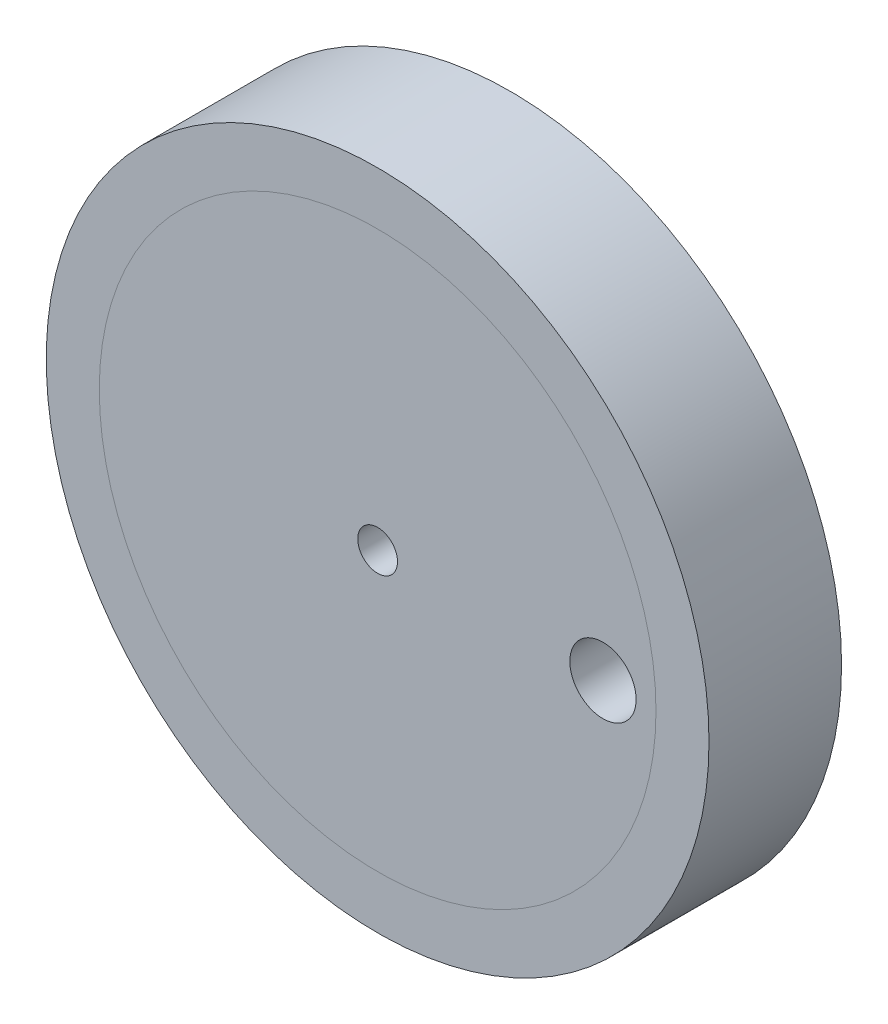
ISO-10303-21;
HEADER;
FILE_DESCRIPTION(('STEP AP214'),'2;1');
FILE_NAME('part.step','',(''),(''),'','','');
FILE_SCHEMA(('AUTOMOTIVE_DESIGN { 1 0 10303 214 1 1 1 1 }'));
ENDSEC;
DATA;
#1=APPLICATION_CONTEXT('core data for automotive mechanical design processes');
#2=APPLICATION_PROTOCOL_DEFINITION('international standard','automotive_design',2000,#1);
#3=PRODUCT_CONTEXT('',#1,'mechanical');
#4=PRODUCT('Part','Part','',(#3));
#5=PRODUCT_RELATED_PRODUCT_CATEGORY('part','',(#4));
#6=PRODUCT_DEFINITION_FORMATION('','',#4);
#7=PRODUCT_DEFINITION_CONTEXT('part definition',#1,'design');
#8=PRODUCT_DEFINITION('design','',#6,#7);
#9=PRODUCT_DEFINITION_SHAPE('','',#8);
#10=(LENGTH_UNIT() NAMED_UNIT(*) SI_UNIT(.MILLI.,.METRE.));
#11=(NAMED_UNIT(*) PLANE_ANGLE_UNIT() SI_UNIT($,.RADIAN.));
#12=(NAMED_UNIT(*) SI_UNIT($,.STERADIAN.) SOLID_ANGLE_UNIT());
#13=UNCERTAINTY_MEASURE_WITH_UNIT(LENGTH_MEASURE(1.E-05),#10,'distance_accuracy_value','');
#14=(GEOMETRIC_REPRESENTATION_CONTEXT(3) GLOBAL_UNCERTAINTY_ASSIGNED_CONTEXT((#13)) GLOBAL_UNIT_ASSIGNED_CONTEXT((#10,
#11,#12)) REPRESENTATION_CONTEXT('',''));
#15=CARTESIAN_POINT('',(0.,0.,0.));
#16=DIRECTION('',(0.,0.,1.));
#17=DIRECTION('',(1.,0.,0.));
#18=AXIS2_PLACEMENT_3D('',#15,#16,#17);
#19=CARTESIAN_POINT('',(-26.1266167793171,11.2614727497056,69.39696961967));
#20=DIRECTION('',(0.,0.,-1.));
#21=DIRECTION('',(-1.,0.,0.));
#22=AXIS2_PLACEMENT_3D('',#19,#20,#21);
#23=CYLINDRICAL_SURFACE('',#22,21.);
#24=CARTESIAN_POINT('',(-26.1266167793171,11.2614727497056,0.));
#25=DIRECTION('',(0.,0.,-1.));
#26=DIRECTION('',(-1.,0.,0.));
#27=AXIS2_PLACEMENT_3D('',#24,#25,#26);
#28=CIRCLE('',#27,21.);
#29=CARTESIAN_POINT('',(-47.1266167793171,11.2614727497056,0.));
#30=VERTEX_POINT('',#29);
#31=EDGE_CURVE('E54',#30,#30,#28,.T.);
#32=ORIENTED_EDGE('',*,*,#31,.F.);
#33=EDGE_LOOP('',(#32));
#34=FACE_BOUND('',#33,.T.);
#35=CARTESIAN_POINT('',(-26.1266167793171,11.2614727497056,10.));
#36=DIRECTION('',(0.,0.,1.));
#37=DIRECTION('',(1.,0.,0.));
#38=AXIS2_PLACEMENT_3D('',#35,#36,#37);
#39=CIRCLE('',#38,21.);
#40=CARTESIAN_POINT('',(-5.12661677931709,11.2614727497056,10.));
#41=VERTEX_POINT('',#40);
#42=EDGE_CURVE('E45',#41,#41,#39,.F.);
#43=ORIENTED_EDGE('',*,*,#42,.T.);
#44=EDGE_LOOP('',(#43));
#45=FACE_BOUND('',#44,.T.);
#46=ADVANCED_FACE('F41',(#34,#45),#23,.T.);
#47=CARTESIAN_POINT('',(-26.1266167793171,11.2614727497056,69.39696961967));
#48=DIRECTION('',(0.,0.,-1.));
#49=DIRECTION('',(-1.,0.,0.));
#50=AXIS2_PLACEMENT_3D('',#47,#48,#49);
#51=CYLINDRICAL_SURFACE('',#50,1.5);
#52=CARTESIAN_POINT('',(-26.1266167793171,11.2614727497056,0.));
#53=DIRECTION('',(0.,0.,-1.));
#54=DIRECTION('',(-1.,0.,0.));
#55=AXIS2_PLACEMENT_3D('',#52,#53,#54);
#56=CIRCLE('',#55,1.5);
#57=CARTESIAN_POINT('',(-27.6266167793171,11.2614727497056,0.));
#58=VERTEX_POINT('',#57);
#59=EDGE_CURVE('E59',#58,#58,#56,.T.);
#60=ORIENTED_EDGE('',*,*,#59,.T.);
#61=EDGE_LOOP('',(#60));
#62=FACE_BOUND('',#61,.T.);
#63=CARTESIAN_POINT('',(-26.1266167793171,11.2614727497056,10.));
#64=DIRECTION('',(0.,0.,1.));
#65=DIRECTION('',(1.,0.,0.));
#66=AXIS2_PLACEMENT_3D('',#63,#64,#65);
#67=CIRCLE('',#66,1.5);
#68=CARTESIAN_POINT('',(-24.6266167793171,11.2614727497056,10.));
#69=VERTEX_POINT('',#68);
#70=EDGE_CURVE('E11',#69,#69,#67,.F.);
#71=ORIENTED_EDGE('',*,*,#70,.F.);
#72=EDGE_LOOP('',(#71));
#73=FACE_BOUND('',#72,.T.);
#74=ADVANCED_FACE('F69',(#62,#73),#51,.F.);
#75=CARTESIAN_POINT('',(-9.12661677931708,11.2614727497056,69.39696961967));
#76=DIRECTION('',(0.,0.,-1.));
#77=DIRECTION('',(-1.,0.,0.));
#78=AXIS2_PLACEMENT_3D('',#75,#76,#77);
#79=CYLINDRICAL_SURFACE('',#78,2.5);
#80=CARTESIAN_POINT('',(-9.12661677931708,11.2614727497056,0.));
#81=DIRECTION('',(0.,0.,-1.));
#82=DIRECTION('',(-1.,0.,0.));
#83=AXIS2_PLACEMENT_3D('',#80,#81,#82);
#84=CIRCLE('',#83,2.5);
#85=CARTESIAN_POINT('',(-11.6266167793171,11.2614727497056,0.));
#86=VERTEX_POINT('',#85);
#87=EDGE_CURVE('E56',#86,#86,#84,.T.);
#88=ORIENTED_EDGE('',*,*,#87,.T.);
#89=EDGE_LOOP('',(#88));
#90=FACE_BOUND('',#89,.T.);
#91=CARTESIAN_POINT('',(-9.12661677931708,11.2614727497056,10.));
#92=DIRECTION('',(0.,0.,1.));
#93=DIRECTION('',(1.,0.,0.));
#94=AXIS2_PLACEMENT_3D('',#91,#92,#93);
#95=CIRCLE('',#94,2.5);
#96=CARTESIAN_POINT('',(-6.62661677931708,11.2614727497056,10.));
#97=VERTEX_POINT('',#96);
#98=EDGE_CURVE('E49',#97,#97,#95,.F.);
#99=ORIENTED_EDGE('',*,*,#98,.F.);
#100=EDGE_LOOP('',(#99));
#101=FACE_BOUND('',#100,.T.);
#102=ADVANCED_FACE('F78',(#90,#101),#79,.F.);
#103=CARTESIAN_POINT('',(-26.1266167793171,11.2614727497056,0.));
#104=DIRECTION('',(0.,0.,-1.));
#105=DIRECTION('',(-1.,0.,0.));
#106=AXIS2_PLACEMENT_3D('',#103,#104,#105);
#107=PLANE('',#106);
#108=ORIENTED_EDGE('',*,*,#87,.F.);
#109=EDGE_LOOP('',(#108));
#110=FACE_BOUND('',#109,.T.);
#111=ORIENTED_EDGE('',*,*,#59,.F.);
#112=EDGE_LOOP('',(#111));
#113=FACE_BOUND('',#112,.T.);
#114=ORIENTED_EDGE('',*,*,#31,.T.);
#115=EDGE_LOOP('',(#114));
#116=FACE_BOUND('',#115,.T.);
#117=ADVANCED_FACE('F65',(#110,#113,#116),#107,.T.);
#118=CARTESIAN_POINT('',(-26.1266167793171,11.2614727497056,10.));
#119=DIRECTION('',(0.,0.,1.));
#120=DIRECTION('',(1.,0.,0.));
#121=AXIS2_PLACEMENT_3D('',#118,#119,#120);
#122=PLANE('',#121);
#123=ORIENTED_EDGE('',*,*,#42,.F.);
#124=EDGE_LOOP('',(#123));
#125=FACE_BOUND('',#124,.T.);
#126=ORIENTED_EDGE('',*,*,#98,.T.);
#127=EDGE_LOOP('',(#126));
#128=FACE_BOUND('',#127,.T.);
#129=ORIENTED_EDGE('',*,*,#70,.T.);
#130=EDGE_LOOP('',(#129));
#131=FACE_BOUND('',#130,.T.);
#132=ADVANCED_FACE('F43',(#125,#128,#131),#122,.T.);
#133=CLOSED_SHELL('',(#46,#74,#102,#117,#132));
#134=MANIFOLD_SOLID_BREP('B2',#133);
#135=CARTESIAN_POINT('',(-26.1266167793171,11.2614727497056,10.));
#136=DIRECTION('',(0.,0.,-1.));
#137=DIRECTION('',(-1.,0.,0.));
#138=AXIS2_PLACEMENT_3D('',#135,#136,#137);
#139=CYLINDRICAL_SURFACE('',#138,25.);
#140=CARTESIAN_POINT('',(-26.1266167793171,11.2614727497056,10.));
#141=DIRECTION('',(0.,0.,1.));
#142=DIRECTION('',(1.,0.,0.));
#143=AXIS2_PLACEMENT_3D('',#140,#141,#142);
#144=CIRCLE('',#143,25.);
#145=CARTESIAN_POINT('',(-1.12661677931708,11.2614727497056,10.));
#146=VERTEX_POINT('',#145);
#147=EDGE_CURVE('E40',#146,#146,#144,.T.);
#148=ORIENTED_EDGE('',*,*,#147,.F.);
#149=EDGE_LOOP('',(#148));
#150=FACE_BOUND('',#149,.T.);
#151=CARTESIAN_POINT('',(-26.1266167793171,11.2614727497056,0.));
#152=DIRECTION('',(0.,0.,1.));
#153=DIRECTION('',(1.,0.,0.));
#154=AXIS2_PLACEMENT_3D('',#151,#152,#153);
#155=CIRCLE('',#154,25.);
#156=CARTESIAN_POINT('',(-1.12661677931708,11.2614727497056,0.));
#157=VERTEX_POINT('',#156);
#158=EDGE_CURVE('E131',#157,#157,#155,.T.);
#159=ORIENTED_EDGE('',*,*,#158,.T.);
#160=EDGE_LOOP('',(#159));
#161=FACE_BOUND('',#160,.T.);
#162=ADVANCED_FACE('F124',(#150,#161),#139,.T.);
#163=CARTESIAN_POINT('',(-26.1266167793171,11.2614727497056,10.));
#164=DIRECTION('',(0.,0.,1.));
#165=DIRECTION('',(1.,0.,0.));
#166=AXIS2_PLACEMENT_3D('',#163,#164,#165);
#167=PLANE('',#166);
#168=CARTESIAN_POINT('',(-26.1266167793171,11.2614727497056,10.));
#169=DIRECTION('',(0.,0.,1.));
#170=DIRECTION('',(1.,0.,0.));
#171=AXIS2_PLACEMENT_3D('',#168,#169,#170);
#172=CIRCLE('',#171,21.);
#173=CARTESIAN_POINT('',(-5.12661677931708,11.2614727497056,10.));
#174=VERTEX_POINT('',#173);
#175=EDGE_CURVE('E137',#174,#174,#172,.T.);
#176=ORIENTED_EDGE('',*,*,#175,.F.);
#177=EDGE_LOOP('',(#176));
#178=FACE_BOUND('',#177,.T.);
#179=ORIENTED_EDGE('',*,*,#147,.T.);
#180=EDGE_LOOP('',(#179));
#181=FACE_BOUND('',#180,.T.);
#182=ADVANCED_FACE('F153',(#178,#181),#167,.T.);
#183=CARTESIAN_POINT('',(-26.1266167793171,11.2614727497056,0.));
#184=DIRECTION('',(0.,0.,1.));
#185=DIRECTION('',(1.,0.,0.));
#186=AXIS2_PLACEMENT_3D('',#183,#184,#185);
#187=PLANE('',#186);
#188=CARTESIAN_POINT('',(-26.1266167793171,11.2614727497056,0.));
#189=DIRECTION('',(0.,0.,1.));
#190=DIRECTION('',(1.,0.,0.));
#191=AXIS2_PLACEMENT_3D('',#188,#189,#190);
#192=CIRCLE('',#191,21.);
#193=CARTESIAN_POINT('',(-5.12661677931708,11.2614727497056,0.));
#194=VERTEX_POINT('',#193);
#195=EDGE_CURVE('E127',#194,#194,#192,.T.);
#196=ORIENTED_EDGE('',*,*,#195,.T.);
#197=EDGE_LOOP('',(#196));
#198=FACE_BOUND('',#197,.T.);
#199=ORIENTED_EDGE('',*,*,#158,.F.);
#200=EDGE_LOOP('',(#199));
#201=FACE_BOUND('',#200,.T.);
#202=ADVANCED_FACE('F144',(#198,#201),#187,.F.);
#203=CARTESIAN_POINT('',(-26.1266167793171,11.2614727497056,-9.99999999994061E-05));
#204=DIRECTION('',(0.,0.,1.));
#205=DIRECTION('',(1.,0.,0.));
#206=AXIS2_PLACEMENT_3D('',#203,#204,#205);
#207=CYLINDRICAL_SURFACE('',#206,21.);
#208=ORIENTED_EDGE('',*,*,#175,.T.);
#209=EDGE_LOOP('',(#208));
#210=FACE_BOUND('',#209,.T.);
#211=ORIENTED_EDGE('',*,*,#195,.F.);
#212=EDGE_LOOP('',(#211));
#213=FACE_BOUND('',#212,.T.);
#214=ADVANCED_FACE('F147',(#210,#213),#207,.F.);
#215=CLOSED_SHELL('',(#162,#182,#202,#214));
#216=MANIFOLD_SOLID_BREP('B6',#215);
#217=ADVANCED_BREP_SHAPE_REPRESENTATION('',(#18,#134,#216),#14);
#218=SHAPE_DEFINITION_REPRESENTATION(#9,#217);
ENDSEC;
END-ISO-10303-21;
